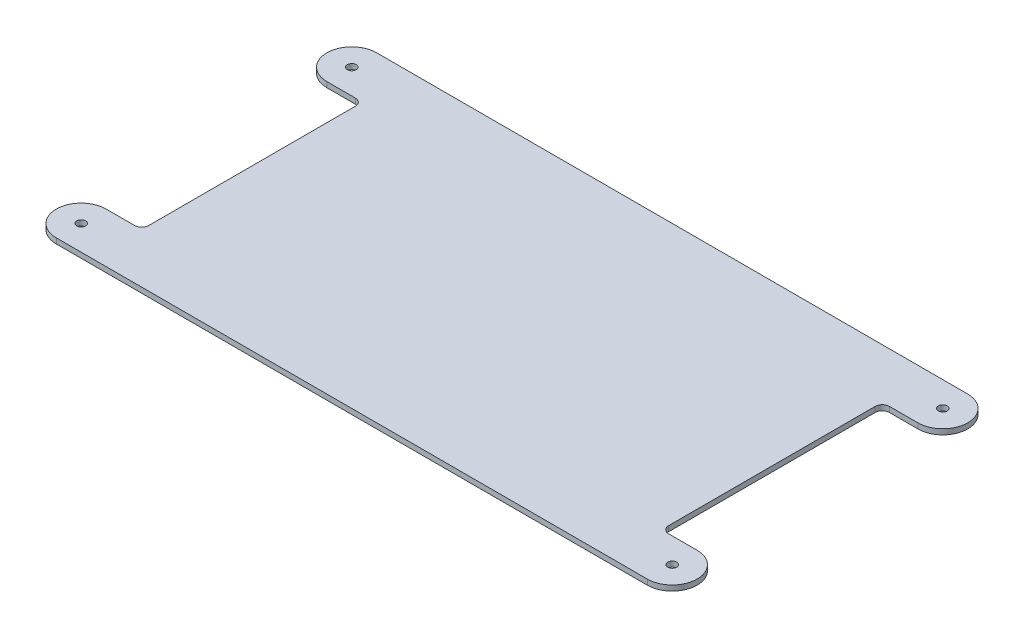
ISO-10303-21;
HEADER;
FILE_DESCRIPTION(('STEP AP214'),'2;1');
FILE_NAME('part.step','',(''),(''),'','','');
FILE_SCHEMA(('AUTOMOTIVE_DESIGN { 1 0 10303 214 1 1 1 1 }'));
ENDSEC;
DATA;
#1=APPLICATION_CONTEXT('core data for automotive mechanical design processes');
#2=APPLICATION_PROTOCOL_DEFINITION('international standard','automotive_design',2000,#1);
#3=PRODUCT_CONTEXT('',#1,'mechanical');
#4=PRODUCT('Part','Part','',(#3));
#5=PRODUCT_RELATED_PRODUCT_CATEGORY('part','',(#4));
#6=PRODUCT_DEFINITION_FORMATION('','',#4);
#7=PRODUCT_DEFINITION_CONTEXT('part definition',#1,'design');
#8=PRODUCT_DEFINITION('design','',#6,#7);
#9=PRODUCT_DEFINITION_SHAPE('','',#8);
#10=(LENGTH_UNIT() NAMED_UNIT(*) SI_UNIT(.MILLI.,.METRE.));
#11=(NAMED_UNIT(*) PLANE_ANGLE_UNIT() SI_UNIT($,.RADIAN.));
#12=(NAMED_UNIT(*) SI_UNIT($,.STERADIAN.) SOLID_ANGLE_UNIT());
#13=UNCERTAINTY_MEASURE_WITH_UNIT(LENGTH_MEASURE(1.E-05),#10,'distance_accuracy_value','');
#14=(GEOMETRIC_REPRESENTATION_CONTEXT(3) GLOBAL_UNCERTAINTY_ASSIGNED_CONTEXT((#13)) GLOBAL_UNIT_ASSIGNED_CONTEXT((#10,
#11,#12)) REPRESENTATION_CONTEXT('',''));
#15=CARTESIAN_POINT('',(0.,0.,0.));
#16=DIRECTION('',(0.,0.,1.));
#17=DIRECTION('',(1.,0.,0.));
#18=AXIS2_PLACEMENT_3D('',#15,#16,#17);
#19=CARTESIAN_POINT('',(-235.457093287225,3.81,-53.8336197195459));
#20=DIRECTION('',(0.,-1.,0.));
#21=DIRECTION('',(0.,0.,-1.));
#22=AXIS2_PLACEMENT_3D('',#19,#20,#21);
#23=CYLINDRICAL_SURFACE('',#22,17.78);
#24=CARTESIAN_POINT('',(-235.457093287225,0.,-53.8336197195459));
#25=DIRECTION('',(0.,1.,0.));
#26=DIRECTION('',(0.,0.,1.));
#27=AXIS2_PLACEMENT_3D('',#24,#25,#26);
#28=CIRCLE('',#27,17.78);
#29=CARTESIAN_POINT('',(-235.457093287225,0.,-71.6136197195459));
#30=VERTEX_POINT('',#29);
#31=CARTESIAN_POINT('',(-235.457093287225,0.,-36.0536197195459));
#32=VERTEX_POINT('',#31);
#33=EDGE_CURVE('E186',#30,#32,#28,.T.);
#34=ORIENTED_EDGE('',*,*,#33,.T.);
#35=DIRECTION('',(0.,-1.,0.));
#36=VECTOR('',#35,1.);
#37=CARTESIAN_POINT('',(-235.457093287225,3.81,-36.0536197195459));
#38=LINE('',#37,#36);
#39=CARTESIAN_POINT('',(-235.457093287225,3.81,-36.0536197195459));
#40=VERTEX_POINT('',#39);
#41=EDGE_CURVE('E49',#40,#32,#38,.T.);
#42=ORIENTED_EDGE('',*,*,#41,.F.);
#43=CARTESIAN_POINT('',(-235.457093287225,3.81,-53.8336197195459));
#44=DIRECTION('',(0.,1.,0.));
#45=DIRECTION('',(0.,0.,1.));
#46=AXIS2_PLACEMENT_3D('',#43,#44,#45);
#47=CIRCLE('',#46,17.78);
#48=CARTESIAN_POINT('',(-235.457093287225,3.81,-71.6136197195459));
#49=VERTEX_POINT('',#48);
#50=EDGE_CURVE('E291',#49,#40,#47,.T.);
#51=ORIENTED_EDGE('',*,*,#50,.F.);
#52=DIRECTION('',(0.,-1.,0.));
#53=VECTOR('',#52,1.);
#54=CARTESIAN_POINT('',(-235.457093287225,3.81,-71.6136197195459));
#55=LINE('',#54,#53);
#56=EDGE_CURVE('E11',#49,#30,#55,.T.);
#57=ORIENTED_EDGE('',*,*,#56,.T.);
#58=EDGE_LOOP('',(#34,#42,#51,#57));
#59=FACE_BOUND('',#58,.T.);
#60=ADVANCED_FACE('F40',(#59),#23,.T.);
#61=CARTESIAN_POINT('',(-215.137093287225,3.81,-36.0536197195459));
#62=DIRECTION('',(0.,0.,-1.));
#63=DIRECTION('',(-1.,0.,0.));
#64=AXIS2_PLACEMENT_3D('',#61,#62,#63);
#65=PLANE('',#64);
#66=DIRECTION('',(1.,0.,0.));
#67=VECTOR('',#66,1.);
#68=CARTESIAN_POINT('',(-215.137093287225,0.,-36.0536197195459));
#69=LINE('',#68,#67);
#70=CARTESIAN_POINT('',(-215.137093287225,0.,-36.0536197195459));
#71=VERTEX_POINT('',#70);
#72=EDGE_CURVE('E188',#32,#71,#69,.T.);
#73=ORIENTED_EDGE('',*,*,#72,.T.);
#74=DIRECTION('',(0.,-1.,0.));
#75=VECTOR('',#74,1.);
#76=CARTESIAN_POINT('',(-215.137093287225,3.81,-36.0536197195459));
#77=LINE('',#76,#75);
#78=CARTESIAN_POINT('',(-215.137093287225,3.81,-36.0536197195459));
#79=VERTEX_POINT('',#78);
#80=EDGE_CURVE('E246',#79,#71,#77,.T.);
#81=ORIENTED_EDGE('',*,*,#80,.F.);
#82=DIRECTION('',(1.,0.,0.));
#83=VECTOR('',#82,1.);
#84=CARTESIAN_POINT('',(-215.137093287225,3.81,-36.0536197195459));
#85=LINE('',#84,#83);
#86=EDGE_CURVE('E288',#40,#79,#85,.T.);
#87=ORIENTED_EDGE('',*,*,#86,.F.);
#88=ORIENTED_EDGE('',*,*,#41,.T.);
#89=EDGE_LOOP('',(#73,#81,#87,#88));
#90=FACE_BOUND('',#89,.T.);
#91=ADVANCED_FACE('F286',(#90),#65,.F.);
#92=CARTESIAN_POINT('',(-215.137093287225,3.81,-30.9736197195459));
#93=DIRECTION('',(0.,-1.,0.));
#94=DIRECTION('',(0.,0.,-1.));
#95=AXIS2_PLACEMENT_3D('',#92,#93,#94);
#96=CYLINDRICAL_SURFACE('',#95,5.08);
#97=CARTESIAN_POINT('',(-215.137093287225,0.,-30.9736197195459));
#98=DIRECTION('',(0.,-1.,0.));
#99=DIRECTION('',(0.,0.,1.));
#100=AXIS2_PLACEMENT_3D('',#97,#98,#99);
#101=CIRCLE('',#100,5.08);
#102=CARTESIAN_POINT('',(-210.057093287225,0.,-30.9736197195459));
#103=VERTEX_POINT('',#102);
#104=EDGE_CURVE('E190',#71,#103,#101,.T.);
#105=ORIENTED_EDGE('',*,*,#104,.T.);
#106=DIRECTION('',(0.,-1.,0.));
#107=VECTOR('',#106,1.);
#108=CARTESIAN_POINT('',(-210.057093287225,3.81,-30.9736197195459));
#109=LINE('',#108,#107);
#110=CARTESIAN_POINT('',(-210.057093287225,3.81,-30.9736197195459));
#111=VERTEX_POINT('',#110);
#112=EDGE_CURVE('E243',#111,#103,#109,.T.);
#113=ORIENTED_EDGE('',*,*,#112,.F.);
#114=CARTESIAN_POINT('',(-215.137093287225,3.81,-30.9736197195459));
#115=DIRECTION('',(0.,-1.,0.));
#116=DIRECTION('',(0.,0.,1.));
#117=AXIS2_PLACEMENT_3D('',#114,#115,#116);
#118=CIRCLE('',#117,5.08);
#119=EDGE_CURVE('E290',#79,#111,#118,.T.);
#120=ORIENTED_EDGE('',*,*,#119,.F.);
#121=ORIENTED_EDGE('',*,*,#80,.T.);
#122=EDGE_LOOP('',(#105,#113,#120,#121));
#123=FACE_BOUND('',#122,.T.);
#124=ADVANCED_FACE('F356',(#123),#96,.F.);
#125=CARTESIAN_POINT('',(-210.057093287225,3.81,-30.9736197195459));
#126=DIRECTION('',(1.,0.,0.));
#127=DIRECTION('',(0.,0.,-1.));
#128=AXIS2_PLACEMENT_3D('',#125,#126,#127);
#129=PLANE('',#128);
#130=DIRECTION('',(0.,0.,1.));
#131=VECTOR('',#130,1.);
#132=CARTESIAN_POINT('',(-210.057093287225,0.,-30.9736197195459));
#133=LINE('',#132,#131);
#134=CARTESIAN_POINT('',(-210.057093287225,0.,116.346380280454));
#135=VERTEX_POINT('',#134);
#136=EDGE_CURVE('E192',#103,#135,#133,.T.);
#137=ORIENTED_EDGE('',*,*,#136,.T.);
#138=DIRECTION('',(0.,-1.,0.));
#139=VECTOR('',#138,1.);
#140=CARTESIAN_POINT('',(-210.057093287225,3.81,116.346380280454));
#141=LINE('',#140,#139);
#142=CARTESIAN_POINT('',(-210.057093287225,3.81,116.346380280454));
#143=VERTEX_POINT('',#142);
#144=EDGE_CURVE('E240',#143,#135,#141,.T.);
#145=ORIENTED_EDGE('',*,*,#144,.F.);
#146=DIRECTION('',(0.,0.,1.));
#147=VECTOR('',#146,1.);
#148=CARTESIAN_POINT('',(-210.057093287225,3.81,-30.9736197195459));
#149=LINE('',#148,#147);
#150=EDGE_CURVE('E293',#111,#143,#149,.T.);
#151=ORIENTED_EDGE('',*,*,#150,.F.);
#152=ORIENTED_EDGE('',*,*,#112,.T.);
#153=EDGE_LOOP('',(#137,#145,#151,#152));
#154=FACE_BOUND('',#153,.T.);
#155=ADVANCED_FACE('F353',(#154),#129,.F.);
#156=CARTESIAN_POINT('',(-215.137093287225,3.81,116.346380280454));
#157=DIRECTION('',(0.,-1.,0.));
#158=DIRECTION('',(0.,0.,-1.));
#159=AXIS2_PLACEMENT_3D('',#156,#157,#158);
#160=CYLINDRICAL_SURFACE('',#159,5.07999999999998);
#161=CARTESIAN_POINT('',(-215.137093287225,0.,116.346380280454));
#162=DIRECTION('',(0.,-1.,0.));
#163=DIRECTION('',(0.,0.,-1.));
#164=AXIS2_PLACEMENT_3D('',#161,#162,#163);
#165=CIRCLE('',#164,5.07999999999998);
#166=CARTESIAN_POINT('',(-215.137093287225,0.,121.426380280454));
#167=VERTEX_POINT('',#166);
#168=EDGE_CURVE('E194',#135,#167,#165,.T.);
#169=ORIENTED_EDGE('',*,*,#168,.T.);
#170=DIRECTION('',(0.,-1.,0.));
#171=VECTOR('',#170,1.);
#172=CARTESIAN_POINT('',(-215.137093287225,3.81,121.426380280454));
#173=LINE('',#172,#171);
#174=CARTESIAN_POINT('',(-215.137093287225,3.81,121.426380280454));
#175=VERTEX_POINT('',#174);
#176=EDGE_CURVE('E237',#175,#167,#173,.T.);
#177=ORIENTED_EDGE('',*,*,#176,.F.);
#178=CARTESIAN_POINT('',(-215.137093287225,3.81,116.346380280454));
#179=DIRECTION('',(0.,-1.,0.));
#180=DIRECTION('',(0.,0.,-1.));
#181=AXIS2_PLACEMENT_3D('',#178,#179,#180);
#182=CIRCLE('',#181,5.07999999999998);
#183=EDGE_CURVE('E299',#143,#175,#182,.T.);
#184=ORIENTED_EDGE('',*,*,#183,.F.);
#185=ORIENTED_EDGE('',*,*,#144,.T.);
#186=EDGE_LOOP('',(#169,#177,#184,#185));
#187=FACE_BOUND('',#186,.T.);
#188=ADVANCED_FACE('F348',(#187),#160,.F.);
#189=CARTESIAN_POINT('',(-215.137093287225,3.81,121.426380280454));
#190=DIRECTION('',(0.,0.,1.));
#191=DIRECTION('',(1.,0.,0.));
#192=AXIS2_PLACEMENT_3D('',#189,#190,#191);
#193=PLANE('',#192);
#194=DIRECTION('',(-1.,0.,0.));
#195=VECTOR('',#194,1.);
#196=CARTESIAN_POINT('',(-215.137093287225,0.,121.426380280454));
#197=LINE('',#196,#195);
#198=CARTESIAN_POINT('',(-235.457093287225,0.,121.426380280454));
#199=VERTEX_POINT('',#198);
#200=EDGE_CURVE('E196',#167,#199,#197,.T.);
#201=ORIENTED_EDGE('',*,*,#200,.T.);
#202=DIRECTION('',(0.,-1.,0.));
#203=VECTOR('',#202,1.);
#204=CARTESIAN_POINT('',(-235.457093287225,3.81,121.426380280454));
#205=LINE('',#204,#203);
#206=CARTESIAN_POINT('',(-235.457093287225,3.81,121.426380280454));
#207=VERTEX_POINT('',#206);
#208=EDGE_CURVE('E234',#207,#199,#205,.T.);
#209=ORIENTED_EDGE('',*,*,#208,.F.);
#210=DIRECTION('',(-1.,0.,0.));
#211=VECTOR('',#210,1.);
#212=CARTESIAN_POINT('',(-215.137093287225,3.81,121.426380280454));
#213=LINE('',#212,#211);
#214=EDGE_CURVE('E301',#175,#207,#213,.T.);
#215=ORIENTED_EDGE('',*,*,#214,.F.);
#216=ORIENTED_EDGE('',*,*,#176,.T.);
#217=EDGE_LOOP('',(#201,#209,#215,#216));
#218=FACE_BOUND('',#217,.T.);
#219=ADVANCED_FACE('F343',(#218),#193,.F.);
#220=CARTESIAN_POINT('',(-235.457093287225,3.81,139.206380280454));
#221=DIRECTION('',(0.,-1.,0.));
#222=DIRECTION('',(0.,0.,-1.));
#223=AXIS2_PLACEMENT_3D('',#220,#221,#222);
#224=CYLINDRICAL_SURFACE('',#223,17.78);
#225=CARTESIAN_POINT('',(-235.457093287225,0.,139.206380280454));
#226=DIRECTION('',(0.,1.,0.));
#227=DIRECTION('',(0.,0.,1.));
#228=AXIS2_PLACEMENT_3D('',#225,#226,#227);
#229=CIRCLE('',#228,17.78);
#230=CARTESIAN_POINT('',(-235.457093287225,0.,156.986380280454));
#231=VERTEX_POINT('',#230);
#232=EDGE_CURVE('E198',#199,#231,#229,.T.);
#233=ORIENTED_EDGE('',*,*,#232,.T.);
#234=DIRECTION('',(0.,-1.,0.));
#235=VECTOR('',#234,1.);
#236=CARTESIAN_POINT('',(-235.457093287225,3.81,156.986380280454));
#237=LINE('',#236,#235);
#238=CARTESIAN_POINT('',(-235.457093287225,3.81,156.986380280454));
#239=VERTEX_POINT('',#238);
#240=EDGE_CURVE('E231',#239,#231,#237,.T.);
#241=ORIENTED_EDGE('',*,*,#240,.F.);
#242=CARTESIAN_POINT('',(-235.457093287225,3.81,139.206380280454));
#243=DIRECTION('',(0.,1.,0.));
#244=DIRECTION('',(0.,0.,1.));
#245=AXIS2_PLACEMENT_3D('',#242,#243,#244);
#246=CIRCLE('',#245,17.78);
#247=EDGE_CURVE('E303',#207,#239,#246,.T.);
#248=ORIENTED_EDGE('',*,*,#247,.F.);
#249=ORIENTED_EDGE('',*,*,#208,.T.);
#250=EDGE_LOOP('',(#233,#241,#248,#249));
#251=FACE_BOUND('',#250,.T.);
#252=ADVANCED_FACE('F338',(#251),#224,.T.);
#253=CARTESIAN_POINT('',(160.782906712775,3.81,156.986380280454));
#254=DIRECTION('',(0.,0.,-1.));
#255=DIRECTION('',(-1.,0.,0.));
#256=AXIS2_PLACEMENT_3D('',#253,#254,#255);
#257=PLANE('',#256);
#258=DIRECTION('',(1.,0.,0.));
#259=VECTOR('',#258,1.);
#260=CARTESIAN_POINT('',(160.782906712775,0.,156.986380280454));
#261=LINE('',#260,#259);
#262=CARTESIAN_POINT('',(186.182906712775,0.,156.986380280454));
#263=VERTEX_POINT('',#262);
#264=EDGE_CURVE('E201',#231,#263,#261,.T.);
#265=ORIENTED_EDGE('',*,*,#264,.T.);
#266=DIRECTION('',(0.,-1.,0.));
#267=VECTOR('',#266,1.);
#268=CARTESIAN_POINT('',(186.182906712775,3.81,156.986380280454));
#269=LINE('',#268,#267);
#270=CARTESIAN_POINT('',(186.182906712775,3.81,156.986380280454));
#271=VERTEX_POINT('',#270);
#272=EDGE_CURVE('E228',#271,#263,#269,.T.);
#273=ORIENTED_EDGE('',*,*,#272,.F.);
#274=DIRECTION('',(1.,0.,0.));
#275=VECTOR('',#274,1.);
#276=CARTESIAN_POINT('',(-106.328404831846,3.81,156.986380280454));
#277=LINE('',#276,#275);
#278=EDGE_CURVE('E305',#239,#271,#277,.T.);
#279=ORIENTED_EDGE('',*,*,#278,.F.);
#280=ORIENTED_EDGE('',*,*,#240,.T.);
#281=EDGE_LOOP('',(#265,#273,#279,#280));
#282=FACE_BOUND('',#281,.T.);
#283=ADVANCED_FACE('F333',(#282),#257,.F.);
#284=CARTESIAN_POINT('',(186.182906712775,3.81,139.206380280454));
#285=DIRECTION('',(0.,-1.,0.));
#286=DIRECTION('',(0.,0.,-1.));
#287=AXIS2_PLACEMENT_3D('',#284,#285,#286);
#288=CYLINDRICAL_SURFACE('',#287,17.78);
#289=CARTESIAN_POINT('',(186.182906712775,0.,139.206380280454));
#290=DIRECTION('',(0.,1.,0.));
#291=DIRECTION('',(0.,0.,-1.));
#292=AXIS2_PLACEMENT_3D('',#289,#290,#291);
#293=CIRCLE('',#292,17.78);
#294=CARTESIAN_POINT('',(186.182906712775,0.,121.426380280454));
#295=VERTEX_POINT('',#294);
#296=EDGE_CURVE('E203',#263,#295,#293,.T.);
#297=ORIENTED_EDGE('',*,*,#296,.T.);
#298=DIRECTION('',(0.,-1.,0.));
#299=VECTOR('',#298,1.);
#300=CARTESIAN_POINT('',(186.182906712775,3.81,121.426380280454));
#301=LINE('',#300,#299);
#302=CARTESIAN_POINT('',(186.182906712775,3.81,121.426380280454));
#303=VERTEX_POINT('',#302);
#304=EDGE_CURVE('E225',#303,#295,#301,.T.);
#305=ORIENTED_EDGE('',*,*,#304,.F.);
#306=CARTESIAN_POINT('',(186.182906712775,3.81,139.206380280454));
#307=DIRECTION('',(0.,1.,0.));
#308=DIRECTION('',(0.,0.,-1.));
#309=AXIS2_PLACEMENT_3D('',#306,#307,#308);
#310=CIRCLE('',#309,17.78);
#311=EDGE_CURVE('E307',#271,#303,#310,.T.);
#312=ORIENTED_EDGE('',*,*,#311,.F.);
#313=ORIENTED_EDGE('',*,*,#272,.T.);
#314=EDGE_LOOP('',(#297,#305,#312,#313));
#315=FACE_BOUND('',#314,.T.);
#316=ADVANCED_FACE('F329',(#315),#288,.T.);
#317=CARTESIAN_POINT('',(165.862906712775,3.81,121.426380280454));
#318=DIRECTION('',(0.,0.,1.));
#319=DIRECTION('',(1.,0.,0.));
#320=AXIS2_PLACEMENT_3D('',#317,#318,#319);
#321=PLANE('',#320);
#322=DIRECTION('',(-1.,0.,0.));
#323=VECTOR('',#322,1.);
#324=CARTESIAN_POINT('',(165.862906712775,0.,121.426380280454));
#325=LINE('',#324,#323);
#326=CARTESIAN_POINT('',(165.862906712775,0.,121.426380280454));
#327=VERTEX_POINT('',#326);
#328=EDGE_CURVE('E205',#295,#327,#325,.T.);
#329=ORIENTED_EDGE('',*,*,#328,.T.);
#330=DIRECTION('',(0.,-1.,0.));
#331=VECTOR('',#330,1.);
#332=CARTESIAN_POINT('',(165.862906712775,3.81,121.426380280454));
#333=LINE('',#332,#331);
#334=CARTESIAN_POINT('',(165.862906712775,3.81,121.426380280454));
#335=VERTEX_POINT('',#334);
#336=EDGE_CURVE('E222',#335,#327,#333,.T.);
#337=ORIENTED_EDGE('',*,*,#336,.F.);
#338=DIRECTION('',(-1.,0.,0.));
#339=VECTOR('',#338,1.);
#340=CARTESIAN_POINT('',(165.862906712775,3.81,121.426380280454));
#341=LINE('',#340,#339);
#342=EDGE_CURVE('E309',#303,#335,#341,.T.);
#343=ORIENTED_EDGE('',*,*,#342,.F.);
#344=ORIENTED_EDGE('',*,*,#304,.T.);
#345=EDGE_LOOP('',(#329,#337,#343,#344));
#346=FACE_BOUND('',#345,.T.);
#347=ADVANCED_FACE('F325',(#346),#321,.F.);
#348=CARTESIAN_POINT('',(165.862906712775,3.81,116.346380280454));
#349=DIRECTION('',(0.,-1.,0.));
#350=DIRECTION('',(0.,0.,-1.));
#351=AXIS2_PLACEMENT_3D('',#348,#349,#350);
#352=CYLINDRICAL_SURFACE('',#351,5.08);
#353=CARTESIAN_POINT('',(165.862906712775,0.,116.346380280454));
#354=DIRECTION('',(0.,-1.,0.));
#355=DIRECTION('',(0.,0.,1.));
#356=AXIS2_PLACEMENT_3D('',#353,#354,#355);
#357=CIRCLE('',#356,5.08);
#358=CARTESIAN_POINT('',(160.782906712775,0.,116.346380280454));
#359=VERTEX_POINT('',#358);
#360=EDGE_CURVE('E207',#327,#359,#357,.T.);
#361=ORIENTED_EDGE('',*,*,#360,.T.);
#362=DIRECTION('',(0.,-1.,0.));
#363=VECTOR('',#362,1.);
#364=CARTESIAN_POINT('',(160.782906712775,3.81,116.346380280454));
#365=LINE('',#364,#363);
#366=CARTESIAN_POINT('',(160.782906712775,3.81,116.346380280454));
#367=VERTEX_POINT('',#366);
#368=EDGE_CURVE('E219',#367,#359,#365,.T.);
#369=ORIENTED_EDGE('',*,*,#368,.F.);
#370=CARTESIAN_POINT('',(165.862906712775,3.81,116.346380280454));
#371=DIRECTION('',(0.,-1.,0.));
#372=DIRECTION('',(0.,0.,1.));
#373=AXIS2_PLACEMENT_3D('',#370,#371,#372);
#374=CIRCLE('',#373,5.08);
#375=EDGE_CURVE('E311',#335,#367,#374,.T.);
#376=ORIENTED_EDGE('',*,*,#375,.F.);
#377=ORIENTED_EDGE('',*,*,#336,.T.);
#378=EDGE_LOOP('',(#361,#369,#376,#377));
#379=FACE_BOUND('',#378,.T.);
#380=ADVANCED_FACE('F317',(#379),#352,.F.);
#381=CARTESIAN_POINT('',(160.782906712775,3.81,-30.9736197195459));
#382=DIRECTION('',(-1.,0.,0.));
#383=DIRECTION('',(0.,0.,1.));
#384=AXIS2_PLACEMENT_3D('',#381,#382,#383);
#385=PLANE('',#384);
#386=DIRECTION('',(0.,0.,-1.));
#387=VECTOR('',#386,1.);
#388=CARTESIAN_POINT('',(160.782906712775,0.,-30.9736197195459));
#389=LINE('',#388,#387);
#390=CARTESIAN_POINT('',(160.782906712775,0.,-30.9736197195459));
#391=VERTEX_POINT('',#390);
#392=EDGE_CURVE('E209',#359,#391,#389,.T.);
#393=ORIENTED_EDGE('',*,*,#392,.T.);
#394=DIRECTION('',(0.,-1.,0.));
#395=VECTOR('',#394,1.);
#396=CARTESIAN_POINT('',(160.782906712775,3.81,-30.9736197195459));
#397=LINE('',#396,#395);
#398=CARTESIAN_POINT('',(160.782906712775,3.81,-30.9736197195459));
#399=VERTEX_POINT('',#398);
#400=EDGE_CURVE('E175',#399,#391,#397,.T.);
#401=ORIENTED_EDGE('',*,*,#400,.F.);
#402=DIRECTION('',(0.,0.,-1.));
#403=VECTOR('',#402,1.);
#404=CARTESIAN_POINT('',(160.782906712775,3.81,-30.9736197195459));
#405=LINE('',#404,#403);
#406=EDGE_CURVE('E166',#367,#399,#405,.T.);
#407=ORIENTED_EDGE('',*,*,#406,.F.);
#408=ORIENTED_EDGE('',*,*,#368,.T.);
#409=EDGE_LOOP('',(#393,#401,#407,#408));
#410=FACE_BOUND('',#409,.T.);
#411=ADVANCED_FACE('F321',(#410),#385,.F.);
#412=CARTESIAN_POINT('',(165.862906712775,3.81,-30.9736197195459));
#413=DIRECTION('',(0.,-1.,0.));
#414=DIRECTION('',(0.,0.,-1.));
#415=AXIS2_PLACEMENT_3D('',#412,#413,#414);
#416=CYLINDRICAL_SURFACE('',#415,5.08000000000002);
#417=CARTESIAN_POINT('',(165.862906712775,0.,-30.9736197195459));
#418=DIRECTION('',(0.,-1.,0.));
#419=DIRECTION('',(0.,0.,-1.));
#420=AXIS2_PLACEMENT_3D('',#417,#418,#419);
#421=CIRCLE('',#420,5.08000000000002);
#422=CARTESIAN_POINT('',(165.862906712775,0.,-36.0536197195459));
#423=VERTEX_POINT('',#422);
#424=EDGE_CURVE('E174',#391,#423,#421,.T.);
#425=ORIENTED_EDGE('',*,*,#424,.T.);
#426=DIRECTION('',(0.,-1.,0.));
#427=VECTOR('',#426,1.);
#428=CARTESIAN_POINT('',(165.862906712775,3.81,-36.0536197195459));
#429=LINE('',#428,#427);
#430=CARTESIAN_POINT('',(165.862906712775,3.81,-36.0536197195459));
#431=VERTEX_POINT('',#430);
#432=EDGE_CURVE('E171',#431,#423,#429,.T.);
#433=ORIENTED_EDGE('',*,*,#432,.F.);
#434=CARTESIAN_POINT('',(165.862906712775,3.81,-30.9736197195459));
#435=DIRECTION('',(0.,-1.,0.));
#436=DIRECTION('',(0.,0.,-1.));
#437=AXIS2_PLACEMENT_3D('',#434,#435,#436);
#438=CIRCLE('',#437,5.08000000000002);
#439=EDGE_CURVE('E160',#399,#431,#438,.T.);
#440=ORIENTED_EDGE('',*,*,#439,.F.);
#441=ORIENTED_EDGE('',*,*,#400,.T.);
#442=EDGE_LOOP('',(#425,#433,#440,#441));
#443=FACE_BOUND('',#442,.T.);
#444=ADVANCED_FACE('F172',(#443),#416,.F.);
#445=CARTESIAN_POINT('',(165.862906712775,3.81,-36.0536197195459));
#446=DIRECTION('',(0.,0.,-1.));
#447=DIRECTION('',(-1.,0.,0.));
#448=AXIS2_PLACEMENT_3D('',#445,#446,#447);
#449=PLANE('',#448);
#450=DIRECTION('',(1.,0.,0.));
#451=VECTOR('',#450,1.);
#452=CARTESIAN_POINT('',(165.862906712775,0.,-36.0536197195459));
#453=LINE('',#452,#451);
#454=CARTESIAN_POINT('',(186.182906712775,0.,-36.0536197195459));
#455=VERTEX_POINT('',#454);
#456=EDGE_CURVE('E112',#423,#455,#453,.T.);
#457=ORIENTED_EDGE('',*,*,#456,.T.);
#458=DIRECTION('',(0.,-1.,0.));
#459=VECTOR('',#458,1.);
#460=CARTESIAN_POINT('',(186.182906712775,3.81,-36.0536197195459));
#461=LINE('',#460,#459);
#462=CARTESIAN_POINT('',(186.182906712775,3.81,-36.0536197195459));
#463=VERTEX_POINT('',#462);
#464=EDGE_CURVE('E176',#463,#455,#461,.T.);
#465=ORIENTED_EDGE('',*,*,#464,.F.);
#466=DIRECTION('',(1.,0.,0.));
#467=VECTOR('',#466,1.);
#468=CARTESIAN_POINT('',(165.862906712775,3.81,-36.0536197195459));
#469=LINE('',#468,#467);
#470=EDGE_CURVE('E164',#431,#463,#469,.T.);
#471=ORIENTED_EDGE('',*,*,#470,.F.);
#472=ORIENTED_EDGE('',*,*,#432,.T.);
#473=EDGE_LOOP('',(#457,#465,#471,#472));
#474=FACE_BOUND('',#473,.T.);
#475=ADVANCED_FACE('F178',(#474),#449,.F.);
#476=CARTESIAN_POINT('',(186.182906712775,3.81,-53.8336197195459));
#477=DIRECTION('',(0.,-1.,0.));
#478=DIRECTION('',(0.,0.,-1.));
#479=AXIS2_PLACEMENT_3D('',#476,#477,#478);
#480=CYLINDRICAL_SURFACE('',#479,17.78);
#481=CARTESIAN_POINT('',(186.182906712775,0.,-53.8336197195459));
#482=DIRECTION('',(0.,1.,0.));
#483=DIRECTION('',(0.,0.,-1.));
#484=AXIS2_PLACEMENT_3D('',#481,#482,#483);
#485=CIRCLE('',#484,17.78);
#486=CARTESIAN_POINT('',(186.182906712775,0.,-71.6136197195459));
#487=VERTEX_POINT('',#486);
#488=EDGE_CURVE('E119',#455,#487,#485,.T.);
#489=ORIENTED_EDGE('',*,*,#488,.T.);
#490=DIRECTION('',(0.,-1.,0.));
#491=VECTOR('',#490,1.);
#492=CARTESIAN_POINT('',(186.182906712775,3.81,-71.6136197195459));
#493=LINE('',#492,#491);
#494=CARTESIAN_POINT('',(186.182906712775,3.81,-71.6136197195459));
#495=VERTEX_POINT('',#494);
#496=EDGE_CURVE('E182',#495,#487,#493,.T.);
#497=ORIENTED_EDGE('',*,*,#496,.F.);
#498=CARTESIAN_POINT('',(186.182906712775,3.81,-53.8336197195459));
#499=DIRECTION('',(0.,1.,0.));
#500=DIRECTION('',(0.,0.,-1.));
#501=AXIS2_PLACEMENT_3D('',#498,#499,#500);
#502=CIRCLE('',#501,17.78);
#503=EDGE_CURVE('E180',#463,#495,#502,.T.);
#504=ORIENTED_EDGE('',*,*,#503,.F.);
#505=ORIENTED_EDGE('',*,*,#464,.T.);
#506=EDGE_LOOP('',(#489,#497,#504,#505));
#507=FACE_BOUND('',#506,.T.);
#508=ADVANCED_FACE('F475',(#507),#480,.T.);
#509=CARTESIAN_POINT('',(160.782906712775,3.81,-71.6136197195458));
#510=DIRECTION('',(0.,0.,1.));
#511=DIRECTION('',(1.,0.,0.));
#512=AXIS2_PLACEMENT_3D('',#509,#510,#511);
#513=PLANE('',#512);
#514=DIRECTION('',(-1.,0.,0.));
#515=VECTOR('',#514,1.);
#516=CARTESIAN_POINT('',(160.782906712775,0.,-71.6136197195458));
#517=LINE('',#516,#515);
#518=EDGE_CURVE('E214',#487,#30,#517,.T.);
#519=ORIENTED_EDGE('',*,*,#518,.T.);
#520=ORIENTED_EDGE('',*,*,#56,.F.);
#521=DIRECTION('',(-1.,0.,0.));
#522=VECTOR('',#521,1.);
#523=CARTESIAN_POINT('',(-106.328404831846,3.81,-71.6136197195458));
#524=LINE('',#523,#522);
#525=EDGE_CURVE('E58',#495,#49,#524,.T.);
#526=ORIENTED_EDGE('',*,*,#525,.F.);
#527=ORIENTED_EDGE('',*,*,#496,.T.);
#528=EDGE_LOOP('',(#519,#520,#526,#527));
#529=FACE_BOUND('',#528,.T.);
#530=ADVANCED_FACE('F485',(#529),#513,.F.);
#531=CARTESIAN_POINT('',(186.182906712775,3.81,-53.8336197195459));
#532=DIRECTION('',(0.,-1.,0.));
#533=DIRECTION('',(0.,0.,-1.));
#534=AXIS2_PLACEMENT_3D('',#531,#532,#533);
#535=PLANE('',#534);
#536=CARTESIAN_POINT('',(-235.457093287225,3.81,139.206380280454));
#537=DIRECTION('',(0.,1.,0.));
#538=DIRECTION('',(0.,0.,1.));
#539=AXIS2_PLACEMENT_3D('',#536,#537,#538);
#540=CIRCLE('',#539,3.175);
#541=CARTESIAN_POINT('',(-235.457093287225,3.81,142.381380280454));
#542=VERTEX_POINT('',#541);
#543=EDGE_CURVE('E598',#542,#542,#540,.T.);
#544=ORIENTED_EDGE('',*,*,#543,.F.);
#545=EDGE_LOOP('',(#544));
#546=FACE_BOUND('',#545,.T.);
#547=CARTESIAN_POINT('',(186.182906712775,3.81,139.206380280454));
#548=DIRECTION('',(0.,1.,0.));
#549=DIRECTION('',(0.,0.,1.));
#550=AXIS2_PLACEMENT_3D('',#547,#548,#549);
#551=CIRCLE('',#550,3.175);
#552=CARTESIAN_POINT('',(186.182906712775,3.81,142.381380280454));
#553=VERTEX_POINT('',#552);
#554=EDGE_CURVE('E595',#553,#553,#551,.T.);
#555=ORIENTED_EDGE('',*,*,#554,.F.);
#556=EDGE_LOOP('',(#555));
#557=FACE_BOUND('',#556,.T.);
#558=CARTESIAN_POINT('',(186.182906712775,3.81,-53.8336197195459));
#559=DIRECTION('',(0.,1.,0.));
#560=DIRECTION('',(0.,0.,1.));
#561=AXIS2_PLACEMENT_3D('',#558,#559,#560);
#562=CIRCLE('',#561,3.175);
#563=CARTESIAN_POINT('',(186.182906712775,3.81,-50.6586197195459));
#564=VERTEX_POINT('',#563);
#565=EDGE_CURVE('E597',#564,#564,#562,.T.);
#566=ORIENTED_EDGE('',*,*,#565,.F.);
#567=EDGE_LOOP('',(#566));
#568=FACE_BOUND('',#567,.T.);
#569=CARTESIAN_POINT('',(-235.457093287225,3.81,-53.8336197195459));
#570=DIRECTION('',(0.,1.,0.));
#571=DIRECTION('',(0.,0.,1.));
#572=AXIS2_PLACEMENT_3D('',#569,#570,#571);
#573=CIRCLE('',#572,3.175);
#574=CARTESIAN_POINT('',(-235.457093287225,3.81,-50.6586197195459));
#575=VERTEX_POINT('',#574);
#576=EDGE_CURVE('E255',#575,#575,#573,.T.);
#577=ORIENTED_EDGE('',*,*,#576,.F.);
#578=EDGE_LOOP('',(#577));
#579=FACE_BOUND('',#578,.T.);
#580=ORIENTED_EDGE('',*,*,#525,.T.);
#581=ORIENTED_EDGE('',*,*,#50,.T.);
#582=ORIENTED_EDGE('',*,*,#86,.T.);
#583=ORIENTED_EDGE('',*,*,#119,.T.);
#584=ORIENTED_EDGE('',*,*,#150,.T.);
#585=ORIENTED_EDGE('',*,*,#183,.T.);
#586=ORIENTED_EDGE('',*,*,#214,.T.);
#587=ORIENTED_EDGE('',*,*,#247,.T.);
#588=ORIENTED_EDGE('',*,*,#278,.T.);
#589=ORIENTED_EDGE('',*,*,#311,.T.);
#590=ORIENTED_EDGE('',*,*,#342,.T.);
#591=ORIENTED_EDGE('',*,*,#375,.T.);
#592=ORIENTED_EDGE('',*,*,#406,.T.);
#593=ORIENTED_EDGE('',*,*,#439,.T.);
#594=ORIENTED_EDGE('',*,*,#470,.T.);
#595=ORIENTED_EDGE('',*,*,#503,.T.);
#596=EDGE_LOOP('',(#580,#581,#582,#583,#584,#585,#586,#587,#588,#589,#590,#591,#592,#593,#594,#595));
#597=FACE_BOUND('',#596,.T.);
#598=ADVANCED_FACE('F162',(#546,#557,#568,#579,#597),#535,.F.);
#599=CARTESIAN_POINT('',(186.182906712775,0.,-53.8336197195459));
#600=DIRECTION('',(0.,-1.,0.));
#601=DIRECTION('',(0.,0.,-1.));
#602=AXIS2_PLACEMENT_3D('',#599,#600,#601);
#603=PLANE('',#602);
#604=CARTESIAN_POINT('',(-235.457093287225,0.,139.206380280454));
#605=DIRECTION('',(0.,-1.,0.));
#606=DIRECTION('',(0.,0.,-1.));
#607=AXIS2_PLACEMENT_3D('',#604,#605,#606);
#608=CIRCLE('',#607,3.175);
#609=CARTESIAN_POINT('',(-235.457093287225,0.,136.031380280454));
#610=VERTEX_POINT('',#609);
#611=EDGE_CURVE('E43',#610,#610,#608,.T.);
#612=ORIENTED_EDGE('',*,*,#611,.F.);
#613=EDGE_LOOP('',(#612));
#614=FACE_BOUND('',#613,.T.);
#615=CARTESIAN_POINT('',(186.182906712775,0.,139.206380280454));
#616=DIRECTION('',(0.,-1.,0.));
#617=DIRECTION('',(0.,0.,-1.));
#618=AXIS2_PLACEMENT_3D('',#615,#616,#617);
#619=CIRCLE('',#618,3.175);
#620=CARTESIAN_POINT('',(186.182906712775,0.,136.031380280454));
#621=VERTEX_POINT('',#620);
#622=EDGE_CURVE('E257',#621,#621,#619,.T.);
#623=ORIENTED_EDGE('',*,*,#622,.F.);
#624=EDGE_LOOP('',(#623));
#625=FACE_BOUND('',#624,.T.);
#626=CARTESIAN_POINT('',(186.182906712775,0.,-53.8336197195459));
#627=DIRECTION('',(0.,-1.,0.));
#628=DIRECTION('',(0.,0.,-1.));
#629=AXIS2_PLACEMENT_3D('',#626,#627,#628);
#630=CIRCLE('',#629,3.175);
#631=CARTESIAN_POINT('',(186.182906712775,0.,-57.0086197195459));
#632=VERTEX_POINT('',#631);
#633=EDGE_CURVE('E254',#632,#632,#630,.T.);
#634=ORIENTED_EDGE('',*,*,#633,.F.);
#635=EDGE_LOOP('',(#634));
#636=FACE_BOUND('',#635,.T.);
#637=CARTESIAN_POINT('',(-235.457093287225,0.,-53.8336197195459));
#638=DIRECTION('',(0.,-1.,0.));
#639=DIRECTION('',(0.,0.,-1.));
#640=AXIS2_PLACEMENT_3D('',#637,#638,#639);
#641=CIRCLE('',#640,3.175);
#642=CARTESIAN_POINT('',(-235.457093287225,0.,-57.0086197195459));
#643=VERTEX_POINT('',#642);
#644=EDGE_CURVE('E251',#643,#643,#641,.T.);
#645=ORIENTED_EDGE('',*,*,#644,.F.);
#646=EDGE_LOOP('',(#645));
#647=FACE_BOUND('',#646,.T.);
#648=ORIENTED_EDGE('',*,*,#33,.F.);
#649=ORIENTED_EDGE('',*,*,#518,.F.);
#650=ORIENTED_EDGE('',*,*,#488,.F.);
#651=ORIENTED_EDGE('',*,*,#456,.F.);
#652=ORIENTED_EDGE('',*,*,#424,.F.);
#653=ORIENTED_EDGE('',*,*,#392,.F.);
#654=ORIENTED_EDGE('',*,*,#360,.F.);
#655=ORIENTED_EDGE('',*,*,#328,.F.);
#656=ORIENTED_EDGE('',*,*,#296,.F.);
#657=ORIENTED_EDGE('',*,*,#264,.F.);
#658=ORIENTED_EDGE('',*,*,#232,.F.);
#659=ORIENTED_EDGE('',*,*,#200,.F.);
#660=ORIENTED_EDGE('',*,*,#168,.F.);
#661=ORIENTED_EDGE('',*,*,#136,.F.);
#662=ORIENTED_EDGE('',*,*,#104,.F.);
#663=ORIENTED_EDGE('',*,*,#72,.F.);
#664=EDGE_LOOP('',(#648,#649,#650,#651,#652,#653,#654,#655,#656,#657,#658,#659,#660,#661,#662,#663));
#665=FACE_BOUND('',#664,.T.);
#666=ADVANCED_FACE('F267',(#614,#625,#636,#647,#665),#603,.T.);
#667=CARTESIAN_POINT('',(-235.457093287225,-82.042,-53.8336197195459));
#668=DIRECTION('',(0.,1.,0.));
#669=DIRECTION('',(0.,0.,1.));
#670=AXIS2_PLACEMENT_3D('',#667,#668,#669);
#671=CYLINDRICAL_SURFACE('',#670,3.175);
#672=ORIENTED_EDGE('',*,*,#644,.T.);
#673=EDGE_LOOP('',(#672));
#674=FACE_BOUND('',#673,.T.);
#675=ORIENTED_EDGE('',*,*,#576,.T.);
#676=EDGE_LOOP('',(#675));
#677=FACE_BOUND('',#676,.T.);
#678=ADVANCED_FACE('F270',(#674,#677),#671,.F.);
#679=CARTESIAN_POINT('',(186.182906712775,-82.042,-53.8336197195459));
#680=DIRECTION('',(0.,1.,0.));
#681=DIRECTION('',(0.,0.,1.));
#682=AXIS2_PLACEMENT_3D('',#679,#680,#681);
#683=CYLINDRICAL_SURFACE('',#682,3.175);
#684=ORIENTED_EDGE('',*,*,#633,.T.);
#685=EDGE_LOOP('',(#684));
#686=FACE_BOUND('',#685,.T.);
#687=ORIENTED_EDGE('',*,*,#565,.T.);
#688=EDGE_LOOP('',(#687));
#689=FACE_BOUND('',#688,.T.);
#690=ADVANCED_FACE('F516',(#686,#689),#683,.F.);
#691=CARTESIAN_POINT('',(186.182906712775,-82.042,139.206380280454));
#692=DIRECTION('',(0.,1.,0.));
#693=DIRECTION('',(0.,0.,1.));
#694=AXIS2_PLACEMENT_3D('',#691,#692,#693);
#695=CYLINDRICAL_SURFACE('',#694,3.175);
#696=ORIENTED_EDGE('',*,*,#622,.T.);
#697=EDGE_LOOP('',(#696));
#698=FACE_BOUND('',#697,.T.);
#699=ORIENTED_EDGE('',*,*,#554,.T.);
#700=EDGE_LOOP('',(#699));
#701=FACE_BOUND('',#700,.T.);
#702=ADVANCED_FACE('F527',(#698,#701),#695,.F.);
#703=CARTESIAN_POINT('',(-235.457093287225,-82.042,139.206380280454));
#704=DIRECTION('',(0.,1.,0.));
#705=DIRECTION('',(0.,0.,1.));
#706=AXIS2_PLACEMENT_3D('',#703,#704,#705);
#707=CYLINDRICAL_SURFACE('',#706,3.175);
#708=ORIENTED_EDGE('',*,*,#611,.T.);
#709=EDGE_LOOP('',(#708));
#710=FACE_BOUND('',#709,.T.);
#711=ORIENTED_EDGE('',*,*,#543,.T.);
#712=EDGE_LOOP('',(#711));
#713=FACE_BOUND('',#712,.T.);
#714=ADVANCED_FACE('F264',(#710,#713),#707,.F.);
#715=CLOSED_SHELL('',(#60,#91,#124,#155,#188,#219,#252,#283,#316,#347,#380,#411,#444,#475,#508,
#530,#598,#666,#678,#690,#702,#714));
#716=MANIFOLD_SOLID_BREP('B2',#715);
#717=ADVANCED_BREP_SHAPE_REPRESENTATION('',(#18,#716),#14);
#718=SHAPE_DEFINITION_REPRESENTATION(#9,#717);
ENDSEC;
END-ISO-10303-21;
